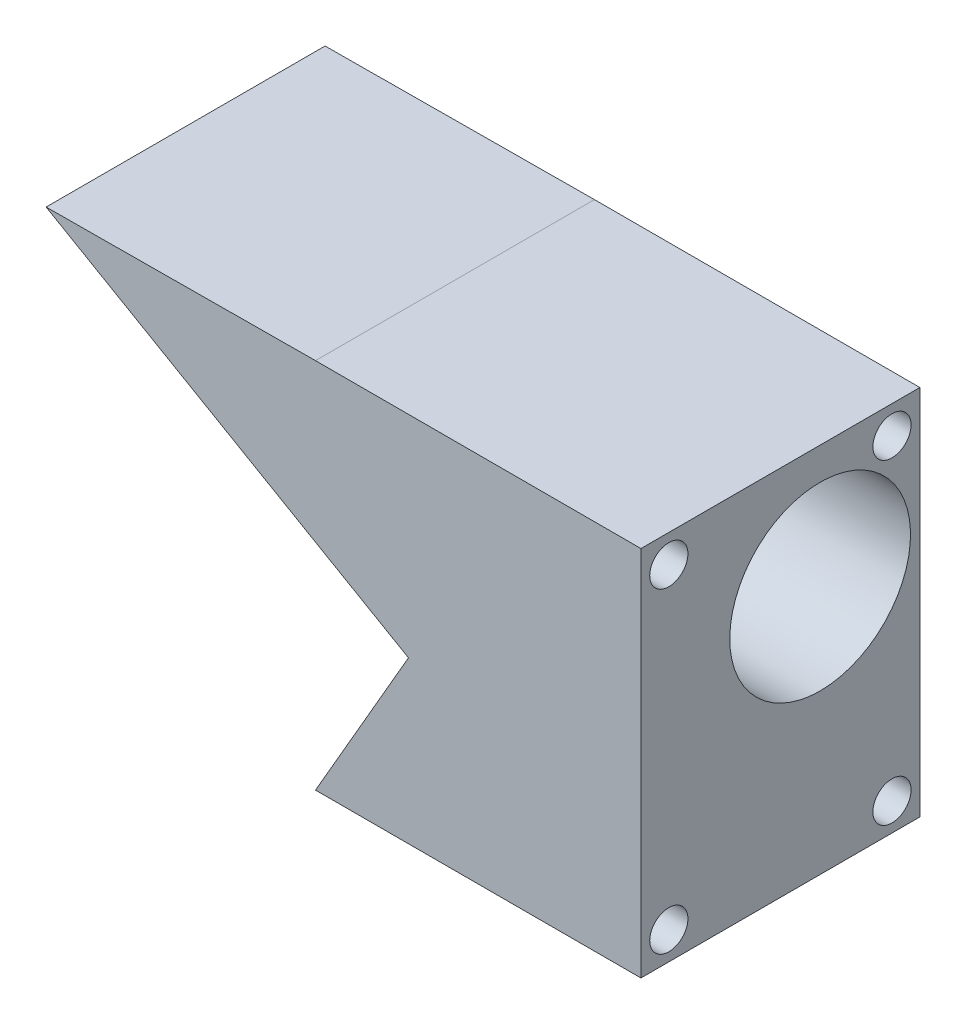
ISO-10303-21;
HEADER;
FILE_DESCRIPTION(('STEP AP214'),'2;1');
FILE_NAME('part.step','',(''),(''),'','','');
FILE_SCHEMA(('AUTOMOTIVE_DESIGN { 1 0 10303 214 1 1 1 1 }'));
ENDSEC;
DATA;
#1=APPLICATION_CONTEXT('core data for automotive mechanical design processes');
#2=APPLICATION_PROTOCOL_DEFINITION('international standard','automotive_design',2000,#1);
#3=PRODUCT_CONTEXT('',#1,'mechanical');
#4=PRODUCT('Part','Part','',(#3));
#5=PRODUCT_RELATED_PRODUCT_CATEGORY('part','',(#4));
#6=PRODUCT_DEFINITION_FORMATION('','',#4);
#7=PRODUCT_DEFINITION_CONTEXT('part definition',#1,'design');
#8=PRODUCT_DEFINITION('design','',#6,#7);
#9=PRODUCT_DEFINITION_SHAPE('','',#8);
#10=(LENGTH_UNIT() NAMED_UNIT(*) SI_UNIT(.MILLI.,.METRE.));
#11=(NAMED_UNIT(*) PLANE_ANGLE_UNIT() SI_UNIT($,.RADIAN.));
#12=(NAMED_UNIT(*) SI_UNIT($,.STERADIAN.) SOLID_ANGLE_UNIT());
#13=UNCERTAINTY_MEASURE_WITH_UNIT(LENGTH_MEASURE(1.E-05),#10,'distance_accuracy_value','');
#14=(GEOMETRIC_REPRESENTATION_CONTEXT(3) GLOBAL_UNCERTAINTY_ASSIGNED_CONTEXT((#13)) GLOBAL_UNIT_ASSIGNED_CONTEXT((#10,
#11,#12)) REPRESENTATION_CONTEXT('',''));
#15=CARTESIAN_POINT('',(0.,0.,0.));
#16=DIRECTION('',(0.,0.,1.));
#17=DIRECTION('',(1.,0.,0.));
#18=AXIS2_PLACEMENT_3D('',#15,#16,#17);
#19=CARTESIAN_POINT('',(-40.5200898437189,-24.4452012726537,-38.1));
#20=DIRECTION('',(0.,1.,0.));
#21=DIRECTION('',(0.,0.,-1.));
#22=AXIS2_PLACEMENT_3D('',#19,#20,#21);
#23=PLANE('',#22);
#24=DIRECTION('',(1.,0.,0.));
#25=VECTOR('',#24,1.);
#26=CARTESIAN_POINT('',(-40.5200898437189,-24.4452012726537,0.));
#27=LINE('',#26,#25);
#28=CARTESIAN_POINT('',(-40.5200898437189,-24.4452012726537,0.));
#29=VERTEX_POINT('',#28);
#30=CARTESIAN_POINT('',(3.92991015628107,-24.4452012726537,0.));
#31=VERTEX_POINT('',#30);
#32=EDGE_CURVE('E93',#29,#31,#27,.T.);
#33=ORIENTED_EDGE('',*,*,#32,.F.);
#34=DIRECTION('',(0.,0.,1.));
#35=VECTOR('',#34,1.);
#36=CARTESIAN_POINT('',(-40.5200898437189,-24.4452012726537,-38.1));
#37=LINE('',#36,#35);
#38=CARTESIAN_POINT('',(-40.5200898437189,-24.4452012726537,-38.1));
#39=VERTEX_POINT('',#38);
#40=EDGE_CURVE('E42',#39,#29,#37,.T.);
#41=ORIENTED_EDGE('',*,*,#40,.F.);
#42=DIRECTION('',(1.,0.,0.));
#43=VECTOR('',#42,1.);
#44=CARTESIAN_POINT('',(-40.5200898437189,-24.4452012726537,-38.1));
#45=LINE('',#44,#43);
#46=CARTESIAN_POINT('',(3.92991015628107,-24.4452012726537,-38.1));
#47=VERTEX_POINT('',#46);
#48=EDGE_CURVE('E79',#39,#47,#45,.T.);
#49=ORIENTED_EDGE('',*,*,#48,.T.);
#50=DIRECTION('',(0.,0.,1.));
#51=VECTOR('',#50,1.);
#52=CARTESIAN_POINT('',(3.92991015628107,-24.4452012726537,-38.1));
#53=LINE('',#52,#51);
#54=EDGE_CURVE('E87',#47,#31,#53,.T.);
#55=ORIENTED_EDGE('',*,*,#54,.T.);
#56=EDGE_LOOP('',(#33,#41,#49,#55));
#57=FACE_BOUND('',#56,.T.);
#58=ADVANCED_FACE('F35',(#57),#23,.F.);
#59=CARTESIAN_POINT('',(3.92991015628107,26.3547987273463,-38.1));
#60=DIRECTION('',(-1.,0.,0.));
#61=DIRECTION('',(0.,-1.,0.));
#62=AXIS2_PLACEMENT_3D('',#59,#60,#61);
#63=PLANE('',#62);
#64=CARTESIAN_POINT('',(3.92991015628107,9.61895089971776,-24.4763703806323));
#65=DIRECTION('',(1.,0.,0.));
#66=DIRECTION('',(0.,-1.,0.));
#67=AXIS2_PLACEMENT_3D('',#64,#65,#66);
#68=CIRCLE('',#67,12.3420151313158);
#69=CARTESIAN_POINT('',(3.92991015628107,-2.72306423159803,-24.4763703806323));
#70=VERTEX_POINT('',#69);
#71=EDGE_CURVE('E193',#70,#70,#68,.T.);
#72=ORIENTED_EDGE('',*,*,#71,.F.);
#73=EDGE_LOOP('',(#72));
#74=FACE_BOUND('',#73,.T.);
#75=CARTESIAN_POINT('',(3.92991015628107,22.5447987273463,-34.29));
#76=DIRECTION('',(-1.,0.,0.));
#77=DIRECTION('',(0.,0.,1.));
#78=AXIS2_PLACEMENT_3D('',#75,#76,#77);
#79=CIRCLE('',#78,2.60984999999999);
#80=CARTESIAN_POINT('',(3.92991015628107,22.5447987273463,-31.68015));
#81=VERTEX_POINT('',#80);
#82=EDGE_CURVE('E175',#81,#81,#79,.T.);
#83=ORIENTED_EDGE('',*,*,#82,.T.);
#84=EDGE_LOOP('',(#83));
#85=FACE_BOUND('',#84,.T.);
#86=CARTESIAN_POINT('',(3.92991015628107,22.5447987273463,-3.81));
#87=DIRECTION('',(-1.,0.,0.));
#88=DIRECTION('',(0.,0.,1.));
#89=AXIS2_PLACEMENT_3D('',#86,#87,#88);
#90=CIRCLE('',#89,2.60984999999999);
#91=CARTESIAN_POINT('',(3.92991015628107,22.5447987273463,-1.20015000000001));
#92=VERTEX_POINT('',#91);
#93=EDGE_CURVE('E169',#92,#92,#90,.T.);
#94=ORIENTED_EDGE('',*,*,#93,.T.);
#95=EDGE_LOOP('',(#94));
#96=FACE_BOUND('',#95,.T.);
#97=CARTESIAN_POINT('',(3.92991015628107,-20.6352012726537,-3.81));
#98=DIRECTION('',(-1.,0.,0.));
#99=DIRECTION('',(0.,0.,1.));
#100=AXIS2_PLACEMENT_3D('',#97,#98,#99);
#101=CIRCLE('',#100,2.60984999999999);
#102=CARTESIAN_POINT('',(3.92991015628107,-20.6352012726537,-1.20015000000001));
#103=VERTEX_POINT('',#102);
#104=EDGE_CURVE('E161',#103,#103,#101,.T.);
#105=ORIENTED_EDGE('',*,*,#104,.T.);
#106=EDGE_LOOP('',(#105));
#107=FACE_BOUND('',#106,.T.);
#108=CARTESIAN_POINT('',(3.92991015628107,-20.6352012726537,-34.29));
#109=DIRECTION('',(-1.,0.,0.));
#110=DIRECTION('',(0.,0.,1.));
#111=AXIS2_PLACEMENT_3D('',#108,#109,#110);
#112=CIRCLE('',#111,2.60984999999999);
#113=CARTESIAN_POINT('',(3.92991015628107,-20.6352012726537,-31.68015));
#114=VERTEX_POINT('',#113);
#115=EDGE_CURVE('E155',#114,#114,#112,.T.);
#116=ORIENTED_EDGE('',*,*,#115,.T.);
#117=EDGE_LOOP('',(#116));
#118=FACE_BOUND('',#117,.T.);
#119=DIRECTION('',(0.,1.,0.));
#120=VECTOR('',#119,1.);
#121=CARTESIAN_POINT('',(3.92991015628107,26.3547987273463,0.));
#122=LINE('',#121,#120);
#123=CARTESIAN_POINT('',(3.92991015628107,26.3547987273463,0.));
#124=VERTEX_POINT('',#123);
#125=EDGE_CURVE('E80',#31,#124,#122,.T.);
#126=ORIENTED_EDGE('',*,*,#125,.F.);
#127=ORIENTED_EDGE('',*,*,#54,.F.);
#128=DIRECTION('',(0.,1.,0.));
#129=VECTOR('',#128,1.);
#130=CARTESIAN_POINT('',(3.92991015628107,26.3547987273463,-38.1));
#131=LINE('',#130,#129);
#132=CARTESIAN_POINT('',(3.92991015628107,26.3547987273463,-38.1));
#133=VERTEX_POINT('',#132);
#134=EDGE_CURVE('E86',#47,#133,#131,.T.);
#135=ORIENTED_EDGE('',*,*,#134,.T.);
#136=DIRECTION('',(0.,0.,1.));
#137=VECTOR('',#136,1.);
#138=CARTESIAN_POINT('',(3.92991015628107,26.3547987273463,-38.1));
#139=LINE('',#138,#137);
#140=EDGE_CURVE('E71',#133,#124,#139,.T.);
#141=ORIENTED_EDGE('',*,*,#140,.T.);
#142=EDGE_LOOP('',(#126,#127,#135,#141));
#143=FACE_BOUND('',#142,.T.);
#144=ADVANCED_FACE('F83',(#74,#85,#96,#107,#118,#143),#63,.F.);
#145=CARTESIAN_POINT('',(-40.5200898437189,26.3547987273463,-38.1));
#146=DIRECTION('',(0.,-1.,0.));
#147=DIRECTION('',(0.,0.,1.));
#148=AXIS2_PLACEMENT_3D('',#145,#146,#147);
#149=PLANE('',#148);
#150=DIRECTION('',(-1.,0.,0.));
#151=VECTOR('',#150,1.);
#152=CARTESIAN_POINT('',(-40.5200898437189,26.3547987273463,0.));
#153=LINE('',#152,#151);
#154=CARTESIAN_POINT('',(-40.5200898437189,26.3547987273463,0.));
#155=VERTEX_POINT('',#154);
#156=EDGE_CURVE('E68',#124,#155,#153,.T.);
#157=ORIENTED_EDGE('',*,*,#156,.F.);
#158=ORIENTED_EDGE('',*,*,#140,.F.);
#159=DIRECTION('',(-1.,0.,0.));
#160=VECTOR('',#159,1.);
#161=CARTESIAN_POINT('',(-40.5200898437189,26.3547987273463,-38.1));
#162=LINE('',#161,#160);
#163=CARTESIAN_POINT('',(-40.5200898437189,26.3547987273463,-38.1));
#164=VERTEX_POINT('',#163);
#165=EDGE_CURVE('E55',#133,#164,#162,.T.);
#166=ORIENTED_EDGE('',*,*,#165,.T.);
#167=DIRECTION('',(0.,0.,1.));
#168=VECTOR('',#167,1.);
#169=CARTESIAN_POINT('',(-40.5200898437189,26.3547987273463,-38.1));
#170=LINE('',#169,#168);
#171=EDGE_CURVE('E75',#164,#155,#170,.T.);
#172=ORIENTED_EDGE('',*,*,#171,.T.);
#173=EDGE_LOOP('',(#157,#158,#166,#172));
#174=FACE_BOUND('',#173,.T.);
#175=ADVANCED_FACE('F70',(#174),#149,.F.);
#176=CARTESIAN_POINT('',(0.,0.,-38.1));
#177=DIRECTION('',(0.,0.,-1.));
#178=DIRECTION('',(1.,0.,0.));
#179=AXIS2_PLACEMENT_3D('',#176,#177,#178);
#180=PLANE('',#179);
#181=DIRECTION('',(-0.5,-0.866025403784438,0.));
#182=VECTOR('',#181,1.);
#183=CARTESIAN_POINT('',(-27.8200898437189,-2.44815601652894,-38.1));
#184=LINE('',#183,#182);
#185=CARTESIAN_POINT('',(-27.8200898437189,-2.44815601652894,-38.1));
#186=VERTEX_POINT('',#185);
#187=EDGE_CURVE('E113',#186,#39,#184,.T.);
#188=ORIENTED_EDGE('',*,*,#187,.F.);
#189=DIRECTION('',(-0.866025403784439,0.5,0.));
#190=VECTOR('',#189,1.);
#191=CARTESIAN_POINT('',(-77.3134416699996,26.1268439834711,-38.1));
#192=LINE('',#191,#190);
#193=CARTESIAN_POINT('',(-77.3134416699996,26.1268439834711,-38.1));
#194=VERTEX_POINT('',#193);
#195=EDGE_CURVE('E182',#186,#194,#192,.T.);
#196=ORIENTED_EDGE('',*,*,#195,.T.);
#197=DIRECTION('',(0.999980808184302,0.00619542275153397,0.));
#198=VECTOR('',#197,1.);
#199=CARTESIAN_POINT('',(-40.5200898437189,26.3547987273463,-38.1));
#200=LINE('',#199,#198);
#201=EDGE_CURVE('E129',#194,#164,#200,.T.);
#202=ORIENTED_EDGE('',*,*,#201,.T.);
#203=ORIENTED_EDGE('',*,*,#165,.F.);
#204=ORIENTED_EDGE('',*,*,#134,.F.);
#205=ORIENTED_EDGE('',*,*,#48,.F.);
#206=EDGE_LOOP('',(#188,#196,#202,#203,#204,#205));
#207=FACE_BOUND('',#206,.T.);
#208=ADVANCED_FACE('F210',(#207),#180,.T.);
#209=CARTESIAN_POINT('',(0.,0.,0.));
#210=DIRECTION('',(0.,0.,-1.));
#211=DIRECTION('',(1.,0.,0.));
#212=AXIS2_PLACEMENT_3D('',#209,#210,#211);
#213=PLANE('',#212);
#214=ORIENTED_EDGE('',*,*,#32,.T.);
#215=ORIENTED_EDGE('',*,*,#125,.T.);
#216=ORIENTED_EDGE('',*,*,#156,.T.);
#217=DIRECTION('',(0.999980808184302,0.00619542275153397,0.));
#218=VECTOR('',#217,1.);
#219=CARTESIAN_POINT('',(-40.5200898437189,26.3547987273463,0.));
#220=LINE('',#219,#218);
#221=CARTESIAN_POINT('',(-77.3134416699996,26.1268439834711,0.));
#222=VERTEX_POINT('',#221);
#223=EDGE_CURVE('E180',#222,#155,#220,.T.);
#224=ORIENTED_EDGE('',*,*,#223,.F.);
#225=DIRECTION('',(-0.866025403784439,0.5,0.));
#226=VECTOR('',#225,1.);
#227=CARTESIAN_POINT('',(-77.3134416699996,26.1268439834711,0.));
#228=LINE('',#227,#226);
#229=CARTESIAN_POINT('',(-27.8200898437189,-2.44815601652894,0.));
#230=VERTEX_POINT('',#229);
#231=EDGE_CURVE('E183',#230,#222,#228,.T.);
#232=ORIENTED_EDGE('',*,*,#231,.F.);
#233=DIRECTION('',(-0.5,-0.866025403784438,0.));
#234=VECTOR('',#233,1.);
#235=CARTESIAN_POINT('',(-27.8200898437189,-2.44815601652894,0.));
#236=LINE('',#235,#234);
#237=EDGE_CURVE('E109',#230,#29,#236,.T.);
#238=ORIENTED_EDGE('',*,*,#237,.T.);
#239=EDGE_LOOP('',(#214,#215,#216,#224,#232,#238));
#240=FACE_BOUND('',#239,.T.);
#241=ADVANCED_FACE('F90',(#240),#213,.F.);
#242=CARTESIAN_POINT('',(-8.77008984371893,-20.6352012726537,-34.29));
#243=DIRECTION('',(1.,0.,0.));
#244=DIRECTION('',(0.,0.,1.));
#245=AXIS2_PLACEMENT_3D('',#242,#243,#244);
#246=CONICAL_SURFACE('',#245,2.60985,1.02974425867665);
#247=CARTESIAN_POINT('',(-10.338245930288,-20.6352012726537,-34.29));
#248=VERTEX_POINT('',#247);
#249=VERTEX_LOOP('',#248);
#250=FACE_BOUND('',#249,.T.);
#251=CARTESIAN_POINT('',(-8.77008984371893,-20.6352012726537,-34.29));
#252=DIRECTION('',(-1.,0.,0.));
#253=DIRECTION('',(0.,0.,1.));
#254=AXIS2_PLACEMENT_3D('',#251,#252,#253);
#255=CIRCLE('',#254,2.60985);
#256=CARTESIAN_POINT('',(-8.77008984371893,-20.6352012726537,-31.68015));
#257=VERTEX_POINT('',#256);
#258=EDGE_CURVE('E95',#257,#257,#255,.T.);
#259=ORIENTED_EDGE('',*,*,#258,.F.);
#260=EDGE_LOOP('',(#259));
#261=FACE_BOUND('',#260,.T.);
#262=ADVANCED_FACE('F147',(#250,#261),#246,.F.);
#263=CARTESIAN_POINT('',(3.92991015628107,-20.6352012726537,-34.29));
#264=DIRECTION('',(1.,0.,0.));
#265=DIRECTION('',(0.,0.,1.));
#266=AXIS2_PLACEMENT_3D('',#263,#264,#265);
#267=CYLINDRICAL_SURFACE('',#266,2.60984999999999);
#268=ORIENTED_EDGE('',*,*,#258,.T.);
#269=EDGE_LOOP('',(#268));
#270=FACE_BOUND('',#269,.T.);
#271=ORIENTED_EDGE('',*,*,#115,.F.);
#272=EDGE_LOOP('',(#271));
#273=FACE_BOUND('',#272,.T.);
#274=ADVANCED_FACE('F150',(#270,#273),#267,.F.);
#275=CARTESIAN_POINT('',(-8.77008984371893,-20.6352012726537,-3.81));
#276=DIRECTION('',(1.,0.,0.));
#277=DIRECTION('',(0.,0.,1.));
#278=AXIS2_PLACEMENT_3D('',#275,#276,#277);
#279=CONICAL_SURFACE('',#278,2.60985,1.02974425867665);
#280=CARTESIAN_POINT('',(-10.338245930288,-20.6352012726537,-3.81));
#281=VERTEX_POINT('',#280);
#282=VERTEX_LOOP('',#281);
#283=FACE_BOUND('',#282,.T.);
#284=CARTESIAN_POINT('',(-8.77008984371893,-20.6352012726537,-3.81));
#285=DIRECTION('',(-1.,0.,0.));
#286=DIRECTION('',(0.,0.,1.));
#287=AXIS2_PLACEMENT_3D('',#284,#285,#286);
#288=CIRCLE('',#287,2.60985);
#289=CARTESIAN_POINT('',(-8.77008984371893,-20.6352012726537,-1.20015));
#290=VERTEX_POINT('',#289);
#291=EDGE_CURVE('E157',#290,#290,#288,.T.);
#292=ORIENTED_EDGE('',*,*,#291,.F.);
#293=EDGE_LOOP('',(#292));
#294=FACE_BOUND('',#293,.T.);
#295=ADVANCED_FACE('F237',(#283,#294),#279,.F.);
#296=CARTESIAN_POINT('',(3.92991015628107,-20.6352012726537,-3.81));
#297=DIRECTION('',(1.,0.,0.));
#298=DIRECTION('',(0.,0.,1.));
#299=AXIS2_PLACEMENT_3D('',#296,#297,#298);
#300=CYLINDRICAL_SURFACE('',#299,2.60984999999999);
#301=ORIENTED_EDGE('',*,*,#291,.T.);
#302=EDGE_LOOP('',(#301));
#303=FACE_BOUND('',#302,.T.);
#304=ORIENTED_EDGE('',*,*,#104,.F.);
#305=EDGE_LOOP('',(#304));
#306=FACE_BOUND('',#305,.T.);
#307=ADVANCED_FACE('F234',(#303,#306),#300,.F.);
#308=CARTESIAN_POINT('',(-8.77008984371893,22.5447987273463,-3.81));
#309=DIRECTION('',(1.,0.,0.));
#310=DIRECTION('',(0.,0.,1.));
#311=AXIS2_PLACEMENT_3D('',#308,#309,#310);
#312=CONICAL_SURFACE('',#311,2.60985,1.02974425867665);
#313=CARTESIAN_POINT('',(-10.338245930288,22.5447987273463,-3.81));
#314=VERTEX_POINT('',#313);
#315=VERTEX_LOOP('',#314);
#316=FACE_BOUND('',#315,.T.);
#317=CARTESIAN_POINT('',(-8.77008984371893,22.5447987273463,-3.81));
#318=DIRECTION('',(-1.,0.,0.));
#319=DIRECTION('',(0.,0.,1.));
#320=AXIS2_PLACEMENT_3D('',#317,#318,#319);
#321=CIRCLE('',#320,2.60985);
#322=CARTESIAN_POINT('',(-8.77008984371893,22.5447987273463,-1.20015));
#323=VERTEX_POINT('',#322);
#324=EDGE_CURVE('E166',#323,#323,#321,.T.);
#325=ORIENTED_EDGE('',*,*,#324,.F.);
#326=EDGE_LOOP('',(#325));
#327=FACE_BOUND('',#326,.T.);
#328=ADVANCED_FACE('F236',(#316,#327),#312,.F.);
#329=CARTESIAN_POINT('',(3.92991015628107,22.5447987273463,-3.81));
#330=DIRECTION('',(1.,0.,0.));
#331=DIRECTION('',(0.,0.,1.));
#332=AXIS2_PLACEMENT_3D('',#329,#330,#331);
#333=CYLINDRICAL_SURFACE('',#332,2.60984999999999);
#334=ORIENTED_EDGE('',*,*,#324,.T.);
#335=EDGE_LOOP('',(#334));
#336=FACE_BOUND('',#335,.T.);
#337=ORIENTED_EDGE('',*,*,#93,.F.);
#338=EDGE_LOOP('',(#337));
#339=FACE_BOUND('',#338,.T.);
#340=ADVANCED_FACE('F244',(#336,#339),#333,.F.);
#341=CARTESIAN_POINT('',(-8.77008984371893,22.5447987273463,-34.29));
#342=DIRECTION('',(1.,0.,0.));
#343=DIRECTION('',(0.,0.,1.));
#344=AXIS2_PLACEMENT_3D('',#341,#342,#343);
#345=CONICAL_SURFACE('',#344,2.60985,1.02974425867665);
#346=CARTESIAN_POINT('',(-10.338245930288,22.5447987273463,-34.29));
#347=VERTEX_POINT('',#346);
#348=VERTEX_LOOP('',#347);
#349=FACE_BOUND('',#348,.T.);
#350=CARTESIAN_POINT('',(-8.77008984371893,22.5447987273463,-34.29));
#351=DIRECTION('',(-1.,0.,0.));
#352=DIRECTION('',(0.,0.,1.));
#353=AXIS2_PLACEMENT_3D('',#350,#351,#352);
#354=CIRCLE('',#353,2.60985);
#355=CARTESIAN_POINT('',(-8.77008984371893,22.5447987273463,-31.68015));
#356=VERTEX_POINT('',#355);
#357=EDGE_CURVE('E172',#356,#356,#354,.T.);
#358=ORIENTED_EDGE('',*,*,#357,.F.);
#359=EDGE_LOOP('',(#358));
#360=FACE_BOUND('',#359,.T.);
#361=ADVANCED_FACE('F280',(#349,#360),#345,.F.);
#362=CARTESIAN_POINT('',(3.92991015628107,22.5447987273463,-34.29));
#363=DIRECTION('',(1.,0.,0.));
#364=DIRECTION('',(0.,0.,1.));
#365=AXIS2_PLACEMENT_3D('',#362,#363,#364);
#366=CYLINDRICAL_SURFACE('',#365,2.60984999999999);
#367=ORIENTED_EDGE('',*,*,#357,.T.);
#368=EDGE_LOOP('',(#367));
#369=FACE_BOUND('',#368,.T.);
#370=ORIENTED_EDGE('',*,*,#82,.F.);
#371=EDGE_LOOP('',(#370));
#372=FACE_BOUND('',#371,.T.);
#373=ADVANCED_FACE('F289',(#369,#372),#366,.F.);
#374=CARTESIAN_POINT('',(-40.5200898437189,26.3547987273463,-38.1));
#375=DIRECTION('',(-0.00619542275153397,0.999980808184302,0.));
#376=DIRECTION('',(-0.999980808184302,-0.00619542275153397,0.));
#377=AXIS2_PLACEMENT_3D('',#374,#375,#376);
#378=PLANE('',#377);
#379=ORIENTED_EDGE('',*,*,#223,.T.);
#380=ORIENTED_EDGE('',*,*,#171,.F.);
#381=ORIENTED_EDGE('',*,*,#201,.F.);
#382=DIRECTION('',(0.,0.,1.));
#383=VECTOR('',#382,1.);
#384=CARTESIAN_POINT('',(-77.3134416699996,26.1268439834711,-38.1));
#385=LINE('',#384,#383);
#386=EDGE_CURVE('E178',#194,#222,#385,.T.);
#387=ORIENTED_EDGE('',*,*,#386,.T.);
#388=EDGE_LOOP('',(#379,#380,#381,#387));
#389=FACE_BOUND('',#388,.T.);
#390=ADVANCED_FACE('F299',(#389),#378,.T.);
#391=CARTESIAN_POINT('',(-77.3134416699996,26.1268439834711,-38.1));
#392=DIRECTION('',(-0.5,-0.866025403784439,0.));
#393=DIRECTION('',(0.866025403784439,-0.5,0.));
#394=AXIS2_PLACEMENT_3D('',#391,#392,#393);
#395=PLANE('',#394);
#396=CARTESIAN_POINT('',(-48.7209321230239,9.61895089971775,-24.4763703806323));
#397=DIRECTION('',(0.5,0.866025403784439,0.));
#398=DIRECTION('',(0.866025403784439,-0.5,0.));
#399=AXIS2_PLACEMENT_3D('',#396,#397,#398);
#400=ELLIPSE('',#399,24.6840302626316,12.3420151313158);
#401=CARTESIAN_POINT('',(-27.8200898437189,-2.44815601652894,-27.0667889131284));
#402=VERTEX_POINT('',#401);
#403=CARTESIAN_POINT('',(-27.8200898437189,-2.44815601652894,-21.8859518481361));
#404=VERTEX_POINT('',#403);
#405=EDGE_CURVE('E197',#402,#404,#400,.T.);
#406=ORIENTED_EDGE('',*,*,#405,.T.);
#407=DIRECTION('',(0.,0.,1.));
#408=VECTOR('',#407,1.);
#409=CARTESIAN_POINT('',(-27.8200898437189,-2.44815601652894,-38.1));
#410=LINE('',#409,#408);
#411=EDGE_CURVE('E191',#404,#230,#410,.T.);
#412=ORIENTED_EDGE('',*,*,#411,.T.);
#413=ORIENTED_EDGE('',*,*,#231,.T.);
#414=ORIENTED_EDGE('',*,*,#386,.F.);
#415=ORIENTED_EDGE('',*,*,#195,.F.);
#416=EDGE_CURVE('E186',#186,#402,#410,.T.);
#417=ORIENTED_EDGE('',*,*,#416,.T.);
#418=EDGE_LOOP('',(#406,#412,#413,#414,#415,#417));
#419=FACE_BOUND('',#418,.T.);
#420=ADVANCED_FACE('F201',(#419),#395,.T.);
#421=CARTESIAN_POINT('',(-27.8200898437189,-2.44815601652894,-38.1));
#422=DIRECTION('',(0.866025403784438,-0.5,0.));
#423=DIRECTION('',(0.5,0.866025403784438,0.));
#424=AXIS2_PLACEMENT_3D('',#421,#422,#423);
#425=PLANE('',#424);
#426=ORIENTED_EDGE('',*,*,#416,.F.);
#427=ORIENTED_EDGE('',*,*,#187,.T.);
#428=ORIENTED_EDGE('',*,*,#40,.T.);
#429=ORIENTED_EDGE('',*,*,#237,.F.);
#430=ORIENTED_EDGE('',*,*,#411,.F.);
#431=CARTESIAN_POINT('',(-20.8531424172839,9.61895089971775,-24.4763703806323));
#432=DIRECTION('',(-0.866025403784438,0.5,0.));
#433=DIRECTION('',(0.5,0.866025403784438,0.));
#434=AXIS2_PLACEMENT_3D('',#431,#432,#433);
#435=ELLIPSE('',#434,14.2513315168152,12.3420151313158);
#436=EDGE_CURVE('E11',#402,#404,#435,.T.);
#437=ORIENTED_EDGE('',*,*,#436,.F.);
#438=EDGE_LOOP('',(#426,#427,#428,#429,#430,#437));
#439=FACE_BOUND('',#438,.T.);
#440=ADVANCED_FACE('F107',(#439),#425,.F.);
#441=CARTESIAN_POINT('',(-77.3134416699996,9.61895089971774,-24.4763703806323));
#442=DIRECTION('',(1.,0.,0.));
#443=DIRECTION('',(0.,1.,0.));
#444=AXIS2_PLACEMENT_3D('',#441,#442,#443);
#445=CYLINDRICAL_SURFACE('',#444,12.3420151313158);
#446=ORIENTED_EDGE('',*,*,#405,.F.);
#447=ORIENTED_EDGE('',*,*,#436,.T.);
#448=EDGE_LOOP('',(#446,#447));
#449=FACE_BOUND('',#448,.T.);
#450=ORIENTED_EDGE('',*,*,#71,.T.);
#451=EDGE_LOOP('',(#450));
#452=FACE_BOUND('',#451,.T.);
#453=ADVANCED_FACE('F204',(#449,#452),#445,.F.);
#454=CLOSED_SHELL('',(#58,#144,#175,#208,#241,#262,#274,#295,#307,#328,#340,#361,#373,#390,#420,
#440,#453));
#455=MANIFOLD_SOLID_BREP('B2',#454);
#456=ADVANCED_BREP_SHAPE_REPRESENTATION('',(#18,#455),#14);
#457=SHAPE_DEFINITION_REPRESENTATION(#9,#456);
ENDSEC;
END-ISO-10303-21;
